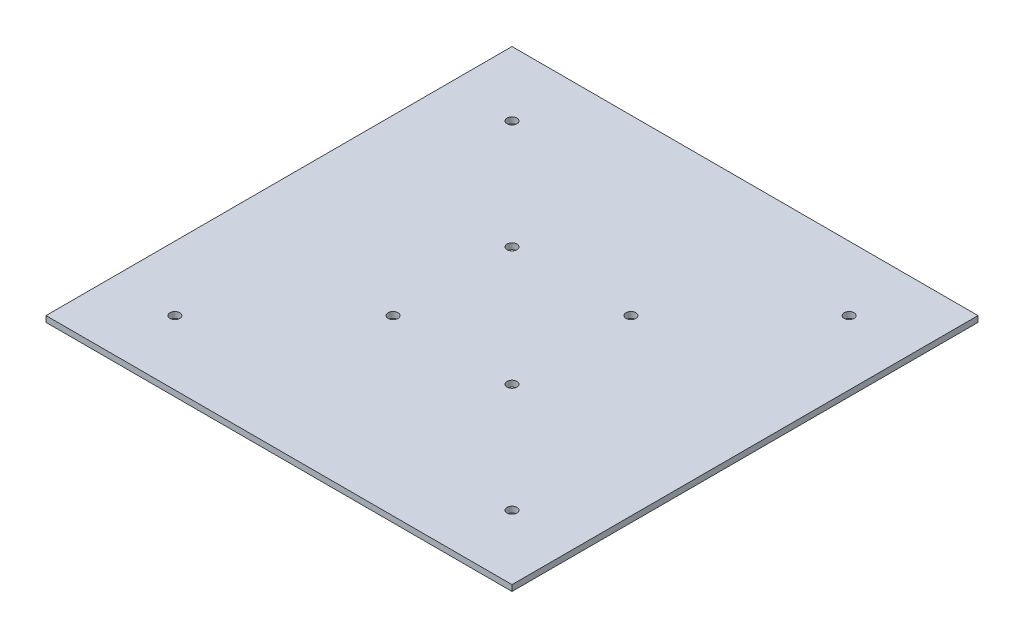
ISO-10303-21;
HEADER;
FILE_DESCRIPTION(('STEP AP214'),'2;1');
FILE_NAME('part.step','',(''),(''),'','','');
FILE_SCHEMA(('AUTOMOTIVE_DESIGN { 1 0 10303 214 1 1 1 1 }'));
ENDSEC;
DATA;
#1=APPLICATION_CONTEXT('core data for automotive mechanical design processes');
#2=APPLICATION_PROTOCOL_DEFINITION('international standard','automotive_design',2000,#1);
#3=PRODUCT_CONTEXT('',#1,'mechanical');
#4=PRODUCT('Part','Part','',(#3));
#5=PRODUCT_RELATED_PRODUCT_CATEGORY('part','',(#4));
#6=PRODUCT_DEFINITION_FORMATION('','',#4);
#7=PRODUCT_DEFINITION_CONTEXT('part definition',#1,'design');
#8=PRODUCT_DEFINITION('design','',#6,#7);
#9=PRODUCT_DEFINITION_SHAPE('','',#8);
#10=(LENGTH_UNIT() NAMED_UNIT(*) SI_UNIT(.MILLI.,.METRE.));
#11=(NAMED_UNIT(*) PLANE_ANGLE_UNIT() SI_UNIT($,.RADIAN.));
#12=(NAMED_UNIT(*) SI_UNIT($,.STERADIAN.) SOLID_ANGLE_UNIT());
#13=UNCERTAINTY_MEASURE_WITH_UNIT(LENGTH_MEASURE(1.E-05),#10,'distance_accuracy_value','');
#14=(GEOMETRIC_REPRESENTATION_CONTEXT(3) GLOBAL_UNCERTAINTY_ASSIGNED_CONTEXT((#13)) GLOBAL_UNIT_ASSIGNED_CONTEXT((#10,
#11,#12)) REPRESENTATION_CONTEXT('',''));
#15=CARTESIAN_POINT('',(0.,0.,0.));
#16=DIRECTION('',(0.,0.,1.));
#17=DIRECTION('',(1.,0.,0.));
#18=AXIS2_PLACEMENT_3D('',#15,#16,#17);
#19=CARTESIAN_POINT('',(0.,3.,0.));
#20=DIRECTION('',(1.,0.,0.));
#21=DIRECTION('',(0.,0.,-1.));
#22=AXIS2_PLACEMENT_3D('',#19,#20,#21);
#23=PLANE('',#22);
#24=DIRECTION('',(0.,0.,1.));
#25=VECTOR('',#24,1.);
#26=CARTESIAN_POINT('',(0.,0.,0.));
#27=LINE('',#26,#25);
#28=CARTESIAN_POINT('',(0.,0.,-235.));
#29=VERTEX_POINT('',#28);
#30=CARTESIAN_POINT('',(0.,0.,0.));
#31=VERTEX_POINT('',#30);
#32=EDGE_CURVE('E108',#29,#31,#27,.T.);
#33=ORIENTED_EDGE('',*,*,#32,.T.);
#34=DIRECTION('',(0.,-1.,0.));
#35=VECTOR('',#34,1.);
#36=CARTESIAN_POINT('',(0.,3.,0.));
#37=LINE('',#36,#35);
#38=CARTESIAN_POINT('',(0.,3.,0.));
#39=VERTEX_POINT('',#38);
#40=EDGE_CURVE('E11',#39,#31,#37,.T.);
#41=ORIENTED_EDGE('',*,*,#40,.F.);
#42=DIRECTION('',(0.,0.,1.));
#43=VECTOR('',#42,1.);
#44=CARTESIAN_POINT('',(0.,3.,0.));
#45=LINE('',#44,#43);
#46=CARTESIAN_POINT('',(0.,3.,-235.));
#47=VERTEX_POINT('',#46);
#48=EDGE_CURVE('E96',#47,#39,#45,.T.);
#49=ORIENTED_EDGE('',*,*,#48,.F.);
#50=DIRECTION('',(0.,-1.,0.));
#51=VECTOR('',#50,1.);
#52=CARTESIAN_POINT('',(0.,3.,-235.));
#53=LINE('',#52,#51);
#54=EDGE_CURVE('E104',#47,#29,#53,.T.);
#55=ORIENTED_EDGE('',*,*,#54,.T.);
#56=EDGE_LOOP('',(#33,#41,#49,#55));
#57=FACE_BOUND('',#56,.T.);
#58=ADVANCED_FACE('F45',(#57),#23,.F.);
#59=CARTESIAN_POINT('',(0.,3.,0.));
#60=DIRECTION('',(0.,0.,-1.));
#61=DIRECTION('',(-1.,0.,0.));
#62=AXIS2_PLACEMENT_3D('',#59,#60,#61);
#63=PLANE('',#62);
#64=DIRECTION('',(1.,0.,0.));
#65=VECTOR('',#64,1.);
#66=CARTESIAN_POINT('',(0.,0.,0.));
#67=LINE('',#66,#65);
#68=CARTESIAN_POINT('',(235.,0.,0.));
#69=VERTEX_POINT('',#68);
#70=EDGE_CURVE('E100',#31,#69,#67,.T.);
#71=ORIENTED_EDGE('',*,*,#70,.T.);
#72=DIRECTION('',(0.,-1.,0.));
#73=VECTOR('',#72,1.);
#74=CARTESIAN_POINT('',(235.,3.,0.));
#75=LINE('',#74,#73);
#76=CARTESIAN_POINT('',(235.,3.,0.));
#77=VERTEX_POINT('',#76);
#78=EDGE_CURVE('E53',#77,#69,#75,.T.);
#79=ORIENTED_EDGE('',*,*,#78,.F.);
#80=DIRECTION('',(1.,0.,0.));
#81=VECTOR('',#80,1.);
#82=CARTESIAN_POINT('',(0.,3.,0.));
#83=LINE('',#82,#81);
#84=EDGE_CURVE('E91',#39,#77,#83,.T.);
#85=ORIENTED_EDGE('',*,*,#84,.F.);
#86=ORIENTED_EDGE('',*,*,#40,.T.);
#87=EDGE_LOOP('',(#71,#79,#85,#86));
#88=FACE_BOUND('',#87,.T.);
#89=ADVANCED_FACE('F99',(#88),#63,.F.);
#90=CARTESIAN_POINT('',(235.,3.,0.));
#91=DIRECTION('',(-1.,0.,0.));
#92=DIRECTION('',(0.,0.,1.));
#93=AXIS2_PLACEMENT_3D('',#90,#91,#92);
#94=PLANE('',#93);
#95=DIRECTION('',(0.,0.,-1.));
#96=VECTOR('',#95,1.);
#97=CARTESIAN_POINT('',(235.,0.,0.));
#98=LINE('',#97,#96);
#99=CARTESIAN_POINT('',(235.,0.,-235.));
#100=VERTEX_POINT('',#99);
#101=EDGE_CURVE('E78',#69,#100,#98,.T.);
#102=ORIENTED_EDGE('',*,*,#101,.T.);
#103=DIRECTION('',(0.,-1.,0.));
#104=VECTOR('',#103,1.);
#105=CARTESIAN_POINT('',(235.,3.,-235.));
#106=LINE('',#105,#104);
#107=CARTESIAN_POINT('',(235.,3.,-235.));
#108=VERTEX_POINT('',#107);
#109=EDGE_CURVE('E101',#108,#100,#106,.T.);
#110=ORIENTED_EDGE('',*,*,#109,.F.);
#111=DIRECTION('',(0.,0.,-1.));
#112=VECTOR('',#111,1.);
#113=CARTESIAN_POINT('',(235.,3.,0.));
#114=LINE('',#113,#112);
#115=EDGE_CURVE('E94',#77,#108,#114,.T.);
#116=ORIENTED_EDGE('',*,*,#115,.F.);
#117=ORIENTED_EDGE('',*,*,#78,.T.);
#118=EDGE_LOOP('',(#102,#110,#116,#117));
#119=FACE_BOUND('',#118,.T.);
#120=ADVANCED_FACE('F102',(#119),#94,.F.);
#121=CARTESIAN_POINT('',(0.,3.,-235.));
#122=DIRECTION('',(0.,0.,1.));
#123=DIRECTION('',(1.,0.,0.));
#124=AXIS2_PLACEMENT_3D('',#121,#122,#123);
#125=PLANE('',#124);
#126=DIRECTION('',(-1.,0.,0.));
#127=VECTOR('',#126,1.);
#128=CARTESIAN_POINT('',(0.,0.,-235.));
#129=LINE('',#128,#127);
#130=EDGE_CURVE('E84',#100,#29,#129,.T.);
#131=ORIENTED_EDGE('',*,*,#130,.T.);
#132=ORIENTED_EDGE('',*,*,#54,.F.);
#133=DIRECTION('',(-1.,0.,0.));
#134=VECTOR('',#133,1.);
#135=CARTESIAN_POINT('',(0.,3.,-235.));
#136=LINE('',#135,#134);
#137=EDGE_CURVE('E61',#108,#47,#136,.T.);
#138=ORIENTED_EDGE('',*,*,#137,.F.);
#139=ORIENTED_EDGE('',*,*,#109,.T.);
#140=EDGE_LOOP('',(#131,#132,#138,#139));
#141=FACE_BOUND('',#140,.T.);
#142=ADVANCED_FACE('F116',(#141),#125,.F.);
#143=CARTESIAN_POINT('',(0.,3.,0.));
#144=DIRECTION('',(0.,-1.,0.));
#145=DIRECTION('',(0.,0.,-1.));
#146=AXIS2_PLACEMENT_3D('',#143,#144,#145);
#147=PLANE('',#146);
#148=CARTESIAN_POINT('',(87.5,3.,-147.5));
#149=DIRECTION('',(0.,1.,0.));
#150=DIRECTION('',(0.,0.,1.));
#151=AXIS2_PLACEMENT_3D('',#148,#149,#150);
#152=CIRCLE('',#151,2.5);
#153=CARTESIAN_POINT('',(87.5,3.,-145.));
#154=VERTEX_POINT('',#153);
#155=EDGE_CURVE('E147',#154,#154,#152,.T.);
#156=ORIENTED_EDGE('',*,*,#155,.F.);
#157=EDGE_LOOP('',(#156));
#158=FACE_BOUND('',#157,.T.);
#159=CARTESIAN_POINT('',(147.5,3.,-147.5));
#160=DIRECTION('',(0.,1.,0.));
#161=DIRECTION('',(0.,0.,-1.));
#162=AXIS2_PLACEMENT_3D('',#159,#160,#161);
#163=CIRCLE('',#162,2.5);
#164=CARTESIAN_POINT('',(147.5,3.,-150.));
#165=VERTEX_POINT('',#164);
#166=EDGE_CURVE('E141',#165,#165,#163,.T.);
#167=ORIENTED_EDGE('',*,*,#166,.F.);
#168=EDGE_LOOP('',(#167));
#169=FACE_BOUND('',#168,.T.);
#170=CARTESIAN_POINT('',(202.5,3.,-202.5));
#171=DIRECTION('',(0.,1.,0.));
#172=DIRECTION('',(0.,0.,-1.));
#173=AXIS2_PLACEMENT_3D('',#170,#171,#172);
#174=CIRCLE('',#173,2.5);
#175=CARTESIAN_POINT('',(202.5,3.,-205.));
#176=VERTEX_POINT('',#175);
#177=EDGE_CURVE('E135',#176,#176,#174,.T.);
#178=ORIENTED_EDGE('',*,*,#177,.F.);
#179=EDGE_LOOP('',(#178));
#180=FACE_BOUND('',#179,.T.);
#181=CARTESIAN_POINT('',(202.5,3.,-32.5));
#182=DIRECTION('',(0.,1.,0.));
#183=DIRECTION('',(0.,0.,1.));
#184=AXIS2_PLACEMENT_3D('',#181,#182,#183);
#185=CIRCLE('',#184,2.5);
#186=CARTESIAN_POINT('',(202.5,3.,-30.));
#187=VERTEX_POINT('',#186);
#188=EDGE_CURVE('E128',#187,#187,#185,.T.);
#189=ORIENTED_EDGE('',*,*,#188,.F.);
#190=EDGE_LOOP('',(#189));
#191=FACE_BOUND('',#190,.T.);
#192=CARTESIAN_POINT('',(147.5,3.,-87.5));
#193=DIRECTION('',(0.,1.,0.));
#194=DIRECTION('',(0.,0.,1.));
#195=AXIS2_PLACEMENT_3D('',#192,#193,#194);
#196=CIRCLE('',#195,2.5);
#197=CARTESIAN_POINT('',(147.5,3.,-85.));
#198=VERTEX_POINT('',#197);
#199=EDGE_CURVE('E164',#198,#198,#196,.T.);
#200=ORIENTED_EDGE('',*,*,#199,.F.);
#201=EDGE_LOOP('',(#200));
#202=FACE_BOUND('',#201,.T.);
#203=CARTESIAN_POINT('',(87.5,3.,-87.5));
#204=DIRECTION('',(0.,1.,0.));
#205=DIRECTION('',(0.,0.,-1.));
#206=AXIS2_PLACEMENT_3D('',#203,#204,#205);
#207=CIRCLE('',#206,2.5);
#208=CARTESIAN_POINT('',(87.5,3.,-90.));
#209=VERTEX_POINT('',#208);
#210=EDGE_CURVE('E158',#209,#209,#207,.T.);
#211=ORIENTED_EDGE('',*,*,#210,.F.);
#212=EDGE_LOOP('',(#211));
#213=FACE_BOUND('',#212,.T.);
#214=CARTESIAN_POINT('',(32.5,3.,-32.5));
#215=DIRECTION('',(0.,1.,0.));
#216=DIRECTION('',(0.,0.,-1.));
#217=AXIS2_PLACEMENT_3D('',#214,#215,#216);
#218=CIRCLE('',#217,2.5);
#219=CARTESIAN_POINT('',(32.5,3.,-35.));
#220=VERTEX_POINT('',#219);
#221=EDGE_CURVE('E152',#220,#220,#218,.T.);
#222=ORIENTED_EDGE('',*,*,#221,.F.);
#223=EDGE_LOOP('',(#222));
#224=FACE_BOUND('',#223,.T.);
#225=CARTESIAN_POINT('',(32.5,3.,-202.5));
#226=DIRECTION('',(0.,1.,0.));
#227=DIRECTION('',(0.,0.,1.));
#228=AXIS2_PLACEMENT_3D('',#225,#226,#227);
#229=CIRCLE('',#228,2.5);
#230=CARTESIAN_POINT('',(32.5,3.,-200.));
#231=VERTEX_POINT('',#230);
#232=EDGE_CURVE('E111',#231,#231,#229,.T.);
#233=ORIENTED_EDGE('',*,*,#232,.F.);
#234=EDGE_LOOP('',(#233));
#235=FACE_BOUND('',#234,.T.);
#236=ORIENTED_EDGE('',*,*,#48,.T.);
#237=ORIENTED_EDGE('',*,*,#84,.T.);
#238=ORIENTED_EDGE('',*,*,#115,.T.);
#239=ORIENTED_EDGE('',*,*,#137,.T.);
#240=EDGE_LOOP('',(#236,#237,#238,#239));
#241=FACE_BOUND('',#240,.T.);
#242=ADVANCED_FACE('F92',(#158,#169,#180,#191,#202,#213,#224,#235,#241),#147,.F.);
#243=CARTESIAN_POINT('',(0.,0.,0.));
#244=DIRECTION('',(0.,-1.,0.));
#245=DIRECTION('',(0.,0.,-1.));
#246=AXIS2_PLACEMENT_3D('',#243,#244,#245);
#247=PLANE('',#246);
#248=CARTESIAN_POINT('',(87.5,0.,-147.5));
#249=DIRECTION('',(0.,-1.,0.));
#250=DIRECTION('',(0.,0.,-1.));
#251=AXIS2_PLACEMENT_3D('',#248,#249,#250);
#252=CIRCLE('',#251,2.5);
#253=CARTESIAN_POINT('',(87.5,0.,-150.));
#254=VERTEX_POINT('',#253);
#255=EDGE_CURVE('E125',#254,#254,#252,.F.);
#256=ORIENTED_EDGE('',*,*,#255,.T.);
#257=EDGE_LOOP('',(#256));
#258=FACE_BOUND('',#257,.T.);
#259=CARTESIAN_POINT('',(147.5,0.,-147.5));
#260=DIRECTION('',(0.,-1.,0.));
#261=DIRECTION('',(0.,0.,-1.));
#262=AXIS2_PLACEMENT_3D('',#259,#260,#261);
#263=CIRCLE('',#262,2.5);
#264=CARTESIAN_POINT('',(147.5,0.,-150.));
#265=VERTEX_POINT('',#264);
#266=EDGE_CURVE('E144',#265,#265,#263,.F.);
#267=ORIENTED_EDGE('',*,*,#266,.T.);
#268=EDGE_LOOP('',(#267));
#269=FACE_BOUND('',#268,.T.);
#270=CARTESIAN_POINT('',(202.5,0.,-202.5));
#271=DIRECTION('',(0.,-1.,0.));
#272=DIRECTION('',(0.,0.,-1.));
#273=AXIS2_PLACEMENT_3D('',#270,#271,#272);
#274=CIRCLE('',#273,2.5);
#275=CARTESIAN_POINT('',(202.5,0.,-205.));
#276=VERTEX_POINT('',#275);
#277=EDGE_CURVE('E138',#276,#276,#274,.F.);
#278=ORIENTED_EDGE('',*,*,#277,.T.);
#279=EDGE_LOOP('',(#278));
#280=FACE_BOUND('',#279,.T.);
#281=CARTESIAN_POINT('',(202.5,0.,-32.5));
#282=DIRECTION('',(0.,-1.,0.));
#283=DIRECTION('',(0.,0.,-1.));
#284=AXIS2_PLACEMENT_3D('',#281,#282,#283);
#285=CIRCLE('',#284,2.5);
#286=CARTESIAN_POINT('',(202.5,0.,-35.));
#287=VERTEX_POINT('',#286);
#288=EDGE_CURVE('E131',#287,#287,#285,.F.);
#289=ORIENTED_EDGE('',*,*,#288,.T.);
#290=EDGE_LOOP('',(#289));
#291=FACE_BOUND('',#290,.T.);
#292=CARTESIAN_POINT('',(147.5,0.,-87.5));
#293=DIRECTION('',(0.,-1.,0.));
#294=DIRECTION('',(0.,0.,-1.));
#295=AXIS2_PLACEMENT_3D('',#292,#293,#294);
#296=CIRCLE('',#295,2.5);
#297=CARTESIAN_POINT('',(147.5,0.,-90.));
#298=VERTEX_POINT('',#297);
#299=EDGE_CURVE('E132',#298,#298,#296,.F.);
#300=ORIENTED_EDGE('',*,*,#299,.T.);
#301=EDGE_LOOP('',(#300));
#302=FACE_BOUND('',#301,.T.);
#303=CARTESIAN_POINT('',(87.5,0.,-87.5));
#304=DIRECTION('',(0.,-1.,0.));
#305=DIRECTION('',(0.,0.,-1.));
#306=AXIS2_PLACEMENT_3D('',#303,#304,#305);
#307=CIRCLE('',#306,2.5);
#308=CARTESIAN_POINT('',(87.5,0.,-90.));
#309=VERTEX_POINT('',#308);
#310=EDGE_CURVE('E161',#309,#309,#307,.F.);
#311=ORIENTED_EDGE('',*,*,#310,.T.);
#312=EDGE_LOOP('',(#311));
#313=FACE_BOUND('',#312,.T.);
#314=CARTESIAN_POINT('',(32.5,0.,-32.5));
#315=DIRECTION('',(0.,-1.,0.));
#316=DIRECTION('',(0.,0.,-1.));
#317=AXIS2_PLACEMENT_3D('',#314,#315,#316);
#318=CIRCLE('',#317,2.5);
#319=CARTESIAN_POINT('',(32.5,0.,-35.));
#320=VERTEX_POINT('',#319);
#321=EDGE_CURVE('E155',#320,#320,#318,.F.);
#322=ORIENTED_EDGE('',*,*,#321,.T.);
#323=EDGE_LOOP('',(#322));
#324=FACE_BOUND('',#323,.T.);
#325=CARTESIAN_POINT('',(32.5,0.,-202.5));
#326=DIRECTION('',(0.,-1.,0.));
#327=DIRECTION('',(0.,0.,-1.));
#328=AXIS2_PLACEMENT_3D('',#325,#326,#327);
#329=CIRCLE('',#328,2.5);
#330=CARTESIAN_POINT('',(32.5,0.,-205.));
#331=VERTEX_POINT('',#330);
#332=EDGE_CURVE('E122',#331,#331,#329,.F.);
#333=ORIENTED_EDGE('',*,*,#332,.T.);
#334=EDGE_LOOP('',(#333));
#335=FACE_BOUND('',#334,.T.);
#336=ORIENTED_EDGE('',*,*,#32,.F.);
#337=ORIENTED_EDGE('',*,*,#130,.F.);
#338=ORIENTED_EDGE('',*,*,#101,.F.);
#339=ORIENTED_EDGE('',*,*,#70,.F.);
#340=EDGE_LOOP('',(#336,#337,#338,#339));
#341=FACE_BOUND('',#340,.T.);
#342=ADVANCED_FACE('F119',(#258,#269,#280,#291,#302,#313,#324,#335,#341),#247,.T.);
#343=CARTESIAN_POINT('',(32.5,-0.00100000000000013,-202.5));
#344=DIRECTION('',(0.,1.,0.));
#345=DIRECTION('',(0.,0.,1.));
#346=AXIS2_PLACEMENT_3D('',#343,#344,#345);
#347=CYLINDRICAL_SURFACE('',#346,2.5);
#348=ORIENTED_EDGE('',*,*,#332,.F.);
#349=EDGE_LOOP('',(#348));
#350=FACE_BOUND('',#349,.T.);
#351=ORIENTED_EDGE('',*,*,#232,.T.);
#352=EDGE_LOOP('',(#351));
#353=FACE_BOUND('',#352,.T.);
#354=ADVANCED_FACE('F190',(#350,#353),#347,.F.);
#355=CARTESIAN_POINT('',(32.5,-0.00100000000000013,-32.5));
#356=DIRECTION('',(0.,1.,0.));
#357=DIRECTION('',(0.,0.,1.));
#358=AXIS2_PLACEMENT_3D('',#355,#356,#357);
#359=CYLINDRICAL_SURFACE('',#358,2.5);
#360=ORIENTED_EDGE('',*,*,#321,.F.);
#361=EDGE_LOOP('',(#360));
#362=FACE_BOUND('',#361,.T.);
#363=ORIENTED_EDGE('',*,*,#221,.T.);
#364=EDGE_LOOP('',(#363));
#365=FACE_BOUND('',#364,.T.);
#366=ADVANCED_FACE('F192',(#362,#365),#359,.F.);
#367=CARTESIAN_POINT('',(87.5,-0.00100000000000013,-87.5));
#368=DIRECTION('',(0.,1.,0.));
#369=DIRECTION('',(0.,0.,1.));
#370=AXIS2_PLACEMENT_3D('',#367,#368,#369);
#371=CYLINDRICAL_SURFACE('',#370,2.5);
#372=ORIENTED_EDGE('',*,*,#310,.F.);
#373=EDGE_LOOP('',(#372));
#374=FACE_BOUND('',#373,.T.);
#375=ORIENTED_EDGE('',*,*,#210,.T.);
#376=EDGE_LOOP('',(#375));
#377=FACE_BOUND('',#376,.T.);
#378=ADVANCED_FACE('F176',(#374,#377),#371,.F.);
#379=CARTESIAN_POINT('',(147.5,-0.00100000000000013,-87.5));
#380=DIRECTION('',(0.,1.,0.));
#381=DIRECTION('',(0.,0.,1.));
#382=AXIS2_PLACEMENT_3D('',#379,#380,#381);
#383=CYLINDRICAL_SURFACE('',#382,2.5);
#384=ORIENTED_EDGE('',*,*,#299,.F.);
#385=EDGE_LOOP('',(#384));
#386=FACE_BOUND('',#385,.T.);
#387=ORIENTED_EDGE('',*,*,#199,.T.);
#388=EDGE_LOOP('',(#387));
#389=FACE_BOUND('',#388,.T.);
#390=ADVANCED_FACE('F172',(#386,#389),#383,.F.);
#391=CARTESIAN_POINT('',(202.5,-0.00100000000000013,-32.5));
#392=DIRECTION('',(0.,1.,0.));
#393=DIRECTION('',(0.,0.,1.));
#394=AXIS2_PLACEMENT_3D('',#391,#392,#393);
#395=CYLINDRICAL_SURFACE('',#394,2.5);
#396=ORIENTED_EDGE('',*,*,#288,.F.);
#397=EDGE_LOOP('',(#396));
#398=FACE_BOUND('',#397,.T.);
#399=ORIENTED_EDGE('',*,*,#188,.T.);
#400=EDGE_LOOP('',(#399));
#401=FACE_BOUND('',#400,.T.);
#402=ADVANCED_FACE('F175',(#398,#401),#395,.F.);
#403=CARTESIAN_POINT('',(202.5,-0.00100000000000013,-202.5));
#404=DIRECTION('',(0.,1.,0.));
#405=DIRECTION('',(0.,0.,1.));
#406=AXIS2_PLACEMENT_3D('',#403,#404,#405);
#407=CYLINDRICAL_SURFACE('',#406,2.5);
#408=ORIENTED_EDGE('',*,*,#277,.F.);
#409=EDGE_LOOP('',(#408));
#410=FACE_BOUND('',#409,.T.);
#411=ORIENTED_EDGE('',*,*,#177,.T.);
#412=EDGE_LOOP('',(#411));
#413=FACE_BOUND('',#412,.T.);
#414=ADVANCED_FACE('F268',(#410,#413),#407,.F.);
#415=CARTESIAN_POINT('',(147.5,-0.00100000000000013,-147.5));
#416=DIRECTION('',(0.,1.,0.));
#417=DIRECTION('',(0.,0.,1.));
#418=AXIS2_PLACEMENT_3D('',#415,#416,#417);
#419=CYLINDRICAL_SURFACE('',#418,2.5);
#420=ORIENTED_EDGE('',*,*,#266,.F.);
#421=EDGE_LOOP('',(#420));
#422=FACE_BOUND('',#421,.T.);
#423=ORIENTED_EDGE('',*,*,#166,.T.);
#424=EDGE_LOOP('',(#423));
#425=FACE_BOUND('',#424,.T.);
#426=ADVANCED_FACE('F277',(#422,#425),#419,.F.);
#427=CARTESIAN_POINT('',(87.5,-0.00100000000000013,-147.5));
#428=DIRECTION('',(0.,1.,0.));
#429=DIRECTION('',(0.,0.,1.));
#430=AXIS2_PLACEMENT_3D('',#427,#428,#429);
#431=CYLINDRICAL_SURFACE('',#430,2.5);
#432=ORIENTED_EDGE('',*,*,#255,.F.);
#433=EDGE_LOOP('',(#432));
#434=FACE_BOUND('',#433,.T.);
#435=ORIENTED_EDGE('',*,*,#155,.T.);
#436=EDGE_LOOP('',(#435));
#437=FACE_BOUND('',#436,.T.);
#438=ADVANCED_FACE('F287',(#434,#437),#431,.F.);
#439=CLOSED_SHELL('',(#58,#89,#120,#142,#242,#342,#354,#366,#378,#390,#402,#414,#426,#438));
#440=MANIFOLD_SOLID_BREP('B2',#439);
#441=ADVANCED_BREP_SHAPE_REPRESENTATION('',(#18,#440),#14);
#442=SHAPE_DEFINITION_REPRESENTATION(#9,#441);
ENDSEC;
END-ISO-10303-21;
